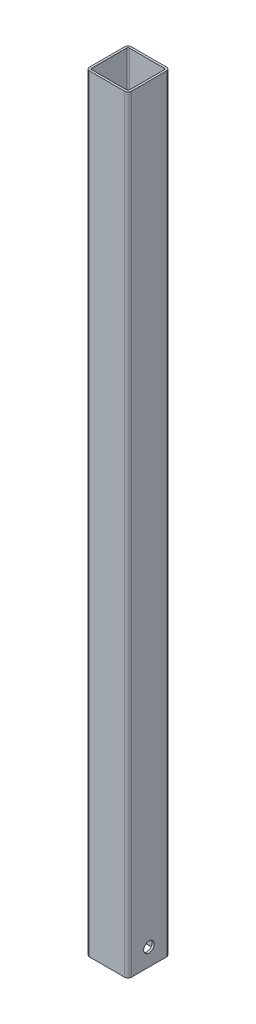
ISO-10303-21;
HEADER;
FILE_DESCRIPTION(('STEP AP214'),'2;1');
FILE_NAME('part.step','',(''),(''),'','','');
FILE_SCHEMA(('AUTOMOTIVE_DESIGN { 1 0 10303 214 1 1 1 1 }'));
ENDSEC;
DATA;
#1=APPLICATION_CONTEXT('core data for automotive mechanical design processes');
#2=APPLICATION_PROTOCOL_DEFINITION('international standard','automotive_design',2000,#1);
#3=PRODUCT_CONTEXT('',#1,'mechanical');
#4=PRODUCT('Part','Part','',(#3));
#5=PRODUCT_RELATED_PRODUCT_CATEGORY('part','',(#4));
#6=PRODUCT_DEFINITION_FORMATION('','',#4);
#7=PRODUCT_DEFINITION_CONTEXT('part definition',#1,'design');
#8=PRODUCT_DEFINITION('design','',#6,#7);
#9=PRODUCT_DEFINITION_SHAPE('','',#8);
#10=(LENGTH_UNIT() NAMED_UNIT(*) SI_UNIT(.MILLI.,.METRE.));
#11=(NAMED_UNIT(*) PLANE_ANGLE_UNIT() SI_UNIT($,.RADIAN.));
#12=(NAMED_UNIT(*) SI_UNIT($,.STERADIAN.) SOLID_ANGLE_UNIT());
#13=UNCERTAINTY_MEASURE_WITH_UNIT(LENGTH_MEASURE(1.E-05),#10,'distance_accuracy_value','');
#14=(GEOMETRIC_REPRESENTATION_CONTEXT(3) GLOBAL_UNCERTAINTY_ASSIGNED_CONTEXT((#13)) GLOBAL_UNIT_ASSIGNED_CONTEXT((#10,
#11,#12)) REPRESENTATION_CONTEXT('',''));
#15=CARTESIAN_POINT('',(0.,0.,0.));
#16=DIRECTION('',(0.,0.,1.));
#17=DIRECTION('',(1.,0.,0.));
#18=AXIS2_PLACEMENT_3D('',#15,#16,#17);
#19=CARTESIAN_POINT('',(-25.,1100.,25.));
#20=DIRECTION('',(0.,1.,0.));
#21=DIRECTION('',(0.,0.,1.));
#22=AXIS2_PLACEMENT_3D('',#19,#20,#21);
#23=PLANE('',#22);
#24=CARTESIAN_POINT('',(-25.,1100.,25.));
#25=DIRECTION('',(0.,1.,0.));
#26=DIRECTION('',(0.,0.,1.));
#27=AXIS2_PLACEMENT_3D('',#24,#25,#26);
#28=CIRCLE('',#27,5.);
#29=CARTESIAN_POINT('',(-30.,1100.,25.));
#30=VERTEX_POINT('',#29);
#31=CARTESIAN_POINT('',(-25.,1100.,30.));
#32=VERTEX_POINT('',#31);
#33=EDGE_CURVE('E264',#30,#32,#28,.T.);
#34=ORIENTED_EDGE('',*,*,#33,.T.);
#35=DIRECTION('',(1.,0.,0.));
#36=VECTOR('',#35,1.);
#37=CARTESIAN_POINT('',(-25.,1100.,30.));
#38=LINE('',#37,#36);
#39=CARTESIAN_POINT('',(25.,1100.,30.));
#40=VERTEX_POINT('',#39);
#41=EDGE_CURVE('E267',#32,#40,#38,.T.);
#42=ORIENTED_EDGE('',*,*,#41,.T.);
#43=CARTESIAN_POINT('',(25.,1100.,25.));
#44=DIRECTION('',(0.,1.,0.));
#45=DIRECTION('',(0.,0.,1.));
#46=AXIS2_PLACEMENT_3D('',#43,#44,#45);
#47=CIRCLE('',#46,5.);
#48=CARTESIAN_POINT('',(30.,1100.,25.));
#49=VERTEX_POINT('',#48);
#50=EDGE_CURVE('E270',#40,#49,#47,.T.);
#51=ORIENTED_EDGE('',*,*,#50,.T.);
#52=DIRECTION('',(0.,0.,-1.));
#53=VECTOR('',#52,1.);
#54=CARTESIAN_POINT('',(30.,1100.,-25.));
#55=LINE('',#54,#53);
#56=CARTESIAN_POINT('',(30.,1100.,-25.));
#57=VERTEX_POINT('',#56);
#58=EDGE_CURVE('E272',#49,#57,#55,.T.);
#59=ORIENTED_EDGE('',*,*,#58,.T.);
#60=CARTESIAN_POINT('',(25.,1100.,-25.));
#61=DIRECTION('',(0.,1.,0.));
#62=DIRECTION('',(0.,0.,-1.));
#63=AXIS2_PLACEMENT_3D('',#60,#61,#62);
#64=CIRCLE('',#63,5.);
#65=CARTESIAN_POINT('',(25.,1100.,-30.));
#66=VERTEX_POINT('',#65);
#67=EDGE_CURVE('E274',#57,#66,#64,.T.);
#68=ORIENTED_EDGE('',*,*,#67,.T.);
#69=DIRECTION('',(-1.,0.,0.));
#70=VECTOR('',#69,1.);
#71=CARTESIAN_POINT('',(-25.,1100.,-30.));
#72=LINE('',#71,#70);
#73=CARTESIAN_POINT('',(-25.,1100.,-30.));
#74=VERTEX_POINT('',#73);
#75=EDGE_CURVE('E276',#66,#74,#72,.T.);
#76=ORIENTED_EDGE('',*,*,#75,.T.);
#77=CARTESIAN_POINT('',(-25.,1100.,-25.));
#78=DIRECTION('',(0.,1.,0.));
#79=DIRECTION('',(0.,0.,1.));
#80=AXIS2_PLACEMENT_3D('',#77,#78,#79);
#81=CIRCLE('',#80,5.);
#82=CARTESIAN_POINT('',(-30.,1100.,-25.));
#83=VERTEX_POINT('',#82);
#84=EDGE_CURVE('E278',#74,#83,#81,.T.);
#85=ORIENTED_EDGE('',*,*,#84,.T.);
#86=DIRECTION('',(0.,0.,1.));
#87=VECTOR('',#86,1.);
#88=CARTESIAN_POINT('',(-30.,1100.,-25.));
#89=LINE('',#88,#87);
#90=EDGE_CURVE('E280',#83,#30,#89,.T.);
#91=ORIENTED_EDGE('',*,*,#90,.T.);
#92=EDGE_LOOP('',(#34,#42,#51,#59,#68,#76,#85,#91));
#93=FACE_BOUND('',#92,.T.);
#94=DIRECTION('',(1.,0.,0.));
#95=VECTOR('',#94,1.);
#96=CARTESIAN_POINT('',(-25.,1100.,27.));
#97=LINE('',#96,#95);
#98=CARTESIAN_POINT('',(-25.,1100.,27.));
#99=VERTEX_POINT('',#98);
#100=CARTESIAN_POINT('',(25.,1100.,27.));
#101=VERTEX_POINT('',#100);
#102=EDGE_CURVE('E205',#99,#101,#97,.T.);
#103=ORIENTED_EDGE('',*,*,#102,.F.);
#104=CARTESIAN_POINT('',(-25.,1100.,25.));
#105=DIRECTION('',(0.,1.,0.));
#106=DIRECTION('',(1.,0.,0.));
#107=AXIS2_PLACEMENT_3D('',#104,#105,#106);
#108=CIRCLE('',#107,2.);
#109=CARTESIAN_POINT('',(-27.,1100.,25.));
#110=VERTEX_POINT('',#109);
#111=EDGE_CURVE('E197',#110,#99,#108,.T.);
#112=ORIENTED_EDGE('',*,*,#111,.F.);
#113=DIRECTION('',(0.,0.,1.));
#114=VECTOR('',#113,1.);
#115=CARTESIAN_POINT('',(-27.,1100.,-25.));
#116=LINE('',#115,#114);
#117=CARTESIAN_POINT('',(-27.,1100.,-25.));
#118=VERTEX_POINT('',#117);
#119=EDGE_CURVE('E231',#118,#110,#116,.T.);
#120=ORIENTED_EDGE('',*,*,#119,.F.);
#121=CARTESIAN_POINT('',(-25.,1100.,-25.));
#122=DIRECTION('',(0.,1.,0.));
#123=DIRECTION('',(1.,0.,0.));
#124=AXIS2_PLACEMENT_3D('',#121,#122,#123);
#125=CIRCLE('',#124,2.);
#126=CARTESIAN_POINT('',(-25.,1100.,-27.));
#127=VERTEX_POINT('',#126);
#128=EDGE_CURVE('E229',#127,#118,#125,.T.);
#129=ORIENTED_EDGE('',*,*,#128,.F.);
#130=DIRECTION('',(-1.,0.,0.));
#131=VECTOR('',#130,1.);
#132=CARTESIAN_POINT('',(-25.,1100.,-27.));
#133=LINE('',#132,#131);
#134=CARTESIAN_POINT('',(25.,1100.,-27.));
#135=VERTEX_POINT('',#134);
#136=EDGE_CURVE('E227',#135,#127,#133,.T.);
#137=ORIENTED_EDGE('',*,*,#136,.F.);
#138=CARTESIAN_POINT('',(25.,1100.,-25.));
#139=DIRECTION('',(0.,1.,0.));
#140=DIRECTION('',(1.,0.,0.));
#141=AXIS2_PLACEMENT_3D('',#138,#139,#140);
#142=CIRCLE('',#141,2.);
#143=CARTESIAN_POINT('',(27.,1100.,-25.));
#144=VERTEX_POINT('',#143);
#145=EDGE_CURVE('E225',#144,#135,#142,.T.);
#146=ORIENTED_EDGE('',*,*,#145,.F.);
#147=DIRECTION('',(0.,0.,-1.));
#148=VECTOR('',#147,1.);
#149=CARTESIAN_POINT('',(27.,1100.,-25.));
#150=LINE('',#149,#148);
#151=CARTESIAN_POINT('',(27.,1100.,25.));
#152=VERTEX_POINT('',#151);
#153=EDGE_CURVE('E220',#152,#144,#150,.T.);
#154=ORIENTED_EDGE('',*,*,#153,.F.);
#155=CARTESIAN_POINT('',(25.,1100.,25.));
#156=DIRECTION('',(0.,1.,0.));
#157=DIRECTION('',(1.,0.,0.));
#158=AXIS2_PLACEMENT_3D('',#155,#156,#157);
#159=CIRCLE('',#158,2.);
#160=EDGE_CURVE('E218',#101,#152,#159,.T.);
#161=ORIENTED_EDGE('',*,*,#160,.F.);
#162=EDGE_LOOP('',(#103,#112,#120,#129,#137,#146,#154,#161));
#163=FACE_BOUND('',#162,.T.);
#164=ADVANCED_FACE('F83',(#93,#163),#23,.T.);
#165=CARTESIAN_POINT('',(-25.,0.,25.));
#166=DIRECTION('',(0.,1.,0.));
#167=DIRECTION('',(0.,0.,1.));
#168=AXIS2_PLACEMENT_3D('',#165,#166,#167);
#169=PLANE('',#168);
#170=CARTESIAN_POINT('',(-25.,0.,25.));
#171=DIRECTION('',(0.,1.,0.));
#172=DIRECTION('',(0.,0.,1.));
#173=AXIS2_PLACEMENT_3D('',#170,#171,#172);
#174=CIRCLE('',#173,5.);
#175=CARTESIAN_POINT('',(-30.,0.,25.));
#176=VERTEX_POINT('',#175);
#177=CARTESIAN_POINT('',(-25.,0.,30.));
#178=VERTEX_POINT('',#177);
#179=EDGE_CURVE('E213',#176,#178,#174,.T.);
#180=ORIENTED_EDGE('',*,*,#179,.F.);
#181=DIRECTION('',(0.,0.,1.));
#182=VECTOR('',#181,1.);
#183=CARTESIAN_POINT('',(-30.,0.,-25.));
#184=LINE('',#183,#182);
#185=CARTESIAN_POINT('',(-30.,0.,-25.));
#186=VERTEX_POINT('',#185);
#187=EDGE_CURVE('E268',#186,#176,#184,.T.);
#188=ORIENTED_EDGE('',*,*,#187,.F.);
#189=CARTESIAN_POINT('',(-25.,0.,-25.));
#190=DIRECTION('',(0.,1.,0.));
#191=DIRECTION('',(0.,0.,1.));
#192=AXIS2_PLACEMENT_3D('',#189,#190,#191);
#193=CIRCLE('',#192,5.);
#194=CARTESIAN_POINT('',(-25.,0.,-30.));
#195=VERTEX_POINT('',#194);
#196=EDGE_CURVE('E295',#195,#186,#193,.T.);
#197=ORIENTED_EDGE('',*,*,#196,.F.);
#198=DIRECTION('',(-1.,0.,0.));
#199=VECTOR('',#198,1.);
#200=CARTESIAN_POINT('',(-25.,0.,-30.));
#201=LINE('',#200,#199);
#202=CARTESIAN_POINT('',(25.,0.,-30.));
#203=VERTEX_POINT('',#202);
#204=EDGE_CURVE('E293',#203,#195,#201,.T.);
#205=ORIENTED_EDGE('',*,*,#204,.F.);
#206=CARTESIAN_POINT('',(25.,0.,-25.));
#207=DIRECTION('',(0.,1.,0.));
#208=DIRECTION('',(0.,0.,-1.));
#209=AXIS2_PLACEMENT_3D('',#206,#207,#208);
#210=CIRCLE('',#209,5.);
#211=CARTESIAN_POINT('',(30.,0.,-25.));
#212=VERTEX_POINT('',#211);
#213=EDGE_CURVE('E291',#212,#203,#210,.T.);
#214=ORIENTED_EDGE('',*,*,#213,.F.);
#215=DIRECTION('',(0.,0.,-1.));
#216=VECTOR('',#215,1.);
#217=CARTESIAN_POINT('',(30.,0.,-25.));
#218=LINE('',#217,#216);
#219=CARTESIAN_POINT('',(30.,0.,25.));
#220=VERTEX_POINT('',#219);
#221=EDGE_CURVE('E289',#220,#212,#218,.T.);
#222=ORIENTED_EDGE('',*,*,#221,.F.);
#223=CARTESIAN_POINT('',(25.,0.,25.));
#224=DIRECTION('',(0.,1.,0.));
#225=DIRECTION('',(0.,0.,1.));
#226=AXIS2_PLACEMENT_3D('',#223,#224,#225);
#227=CIRCLE('',#226,5.);
#228=CARTESIAN_POINT('',(25.,0.,30.));
#229=VERTEX_POINT('',#228);
#230=EDGE_CURVE('E287',#229,#220,#227,.T.);
#231=ORIENTED_EDGE('',*,*,#230,.F.);
#232=DIRECTION('',(1.,0.,0.));
#233=VECTOR('',#232,1.);
#234=CARTESIAN_POINT('',(-25.,0.,30.));
#235=LINE('',#234,#233);
#236=EDGE_CURVE('E285',#178,#229,#235,.T.);
#237=ORIENTED_EDGE('',*,*,#236,.F.);
#238=EDGE_LOOP('',(#180,#188,#197,#205,#214,#222,#231,#237));
#239=FACE_BOUND('',#238,.T.);
#240=CARTESIAN_POINT('',(-25.,0.,25.));
#241=DIRECTION('',(0.,1.,0.));
#242=DIRECTION('',(1.,0.,0.));
#243=AXIS2_PLACEMENT_3D('',#240,#241,#242);
#244=CIRCLE('',#243,2.);
#245=CARTESIAN_POINT('',(-27.,0.,25.));
#246=VERTEX_POINT('',#245);
#247=CARTESIAN_POINT('',(-25.,0.,27.));
#248=VERTEX_POINT('',#247);
#249=EDGE_CURVE('E107',#246,#248,#244,.T.);
#250=ORIENTED_EDGE('',*,*,#249,.T.);
#251=DIRECTION('',(1.,0.,0.));
#252=VECTOR('',#251,1.);
#253=CARTESIAN_POINT('',(-25.,0.,27.));
#254=LINE('',#253,#252);
#255=CARTESIAN_POINT('',(25.,0.,27.));
#256=VERTEX_POINT('',#255);
#257=EDGE_CURVE('E212',#248,#256,#254,.T.);
#258=ORIENTED_EDGE('',*,*,#257,.T.);
#259=CARTESIAN_POINT('',(25.,0.,25.));
#260=DIRECTION('',(0.,1.,0.));
#261=DIRECTION('',(1.,0.,0.));
#262=AXIS2_PLACEMENT_3D('',#259,#260,#261);
#263=CIRCLE('',#262,2.);
#264=CARTESIAN_POINT('',(27.,0.,25.));
#265=VERTEX_POINT('',#264);
#266=EDGE_CURVE('E236',#256,#265,#263,.T.);
#267=ORIENTED_EDGE('',*,*,#266,.T.);
#268=DIRECTION('',(0.,0.,-1.));
#269=VECTOR('',#268,1.);
#270=CARTESIAN_POINT('',(27.,0.,-25.));
#271=LINE('',#270,#269);
#272=CARTESIAN_POINT('',(27.,0.,-25.));
#273=VERTEX_POINT('',#272);
#274=EDGE_CURVE('E239',#265,#273,#271,.T.);
#275=ORIENTED_EDGE('',*,*,#274,.T.);
#276=CARTESIAN_POINT('',(25.,0.,-25.));
#277=DIRECTION('',(0.,1.,0.));
#278=DIRECTION('',(1.,0.,0.));
#279=AXIS2_PLACEMENT_3D('',#276,#277,#278);
#280=CIRCLE('',#279,2.);
#281=CARTESIAN_POINT('',(25.,0.,-27.));
#282=VERTEX_POINT('',#281);
#283=EDGE_CURVE('E242',#273,#282,#280,.T.);
#284=ORIENTED_EDGE('',*,*,#283,.T.);
#285=DIRECTION('',(-1.,0.,0.));
#286=VECTOR('',#285,1.);
#287=CARTESIAN_POINT('',(-25.,0.,-27.));
#288=LINE('',#287,#286);
#289=CARTESIAN_POINT('',(-25.,0.,-27.));
#290=VERTEX_POINT('',#289);
#291=EDGE_CURVE('E245',#282,#290,#288,.T.);
#292=ORIENTED_EDGE('',*,*,#291,.T.);
#293=CARTESIAN_POINT('',(-25.,0.,-25.));
#294=DIRECTION('',(0.,1.,0.));
#295=DIRECTION('',(1.,0.,0.));
#296=AXIS2_PLACEMENT_3D('',#293,#294,#295);
#297=CIRCLE('',#296,2.);
#298=CARTESIAN_POINT('',(-27.,0.,-25.));
#299=VERTEX_POINT('',#298);
#300=EDGE_CURVE('E248',#290,#299,#297,.T.);
#301=ORIENTED_EDGE('',*,*,#300,.T.);
#302=DIRECTION('',(0.,0.,1.));
#303=VECTOR('',#302,1.);
#304=CARTESIAN_POINT('',(-27.,0.,-25.));
#305=LINE('',#304,#303);
#306=EDGE_CURVE('E206',#299,#246,#305,.T.);
#307=ORIENTED_EDGE('',*,*,#306,.T.);
#308=EDGE_LOOP('',(#250,#258,#267,#275,#284,#292,#301,#307));
#309=FACE_BOUND('',#308,.T.);
#310=ADVANCED_FACE('F326',(#239,#309),#169,.F.);
#311=CARTESIAN_POINT('',(-25.,1100.,25.));
#312=DIRECTION('',(0.,-1.,0.));
#313=DIRECTION('',(0.,0.,-1.));
#314=AXIS2_PLACEMENT_3D('',#311,#312,#313);
#315=CYLINDRICAL_SURFACE('',#314,5.);
#316=ORIENTED_EDGE('',*,*,#179,.T.);
#317=DIRECTION('',(0.,-1.,0.));
#318=VECTOR('',#317,1.);
#319=CARTESIAN_POINT('',(-25.,1100.,30.));
#320=LINE('',#319,#318);
#321=EDGE_CURVE('E12',#32,#178,#320,.T.);
#322=ORIENTED_EDGE('',*,*,#321,.F.);
#323=ORIENTED_EDGE('',*,*,#33,.F.);
#324=DIRECTION('',(0.,-1.,0.));
#325=VECTOR('',#324,1.);
#326=CARTESIAN_POINT('',(-30.,1100.,25.));
#327=LINE('',#326,#325);
#328=EDGE_CURVE('E282',#30,#176,#327,.T.);
#329=ORIENTED_EDGE('',*,*,#328,.T.);
#330=EDGE_LOOP('',(#316,#322,#323,#329));
#331=FACE_BOUND('',#330,.T.);
#332=ADVANCED_FACE('F85',(#331),#315,.T.);
#333=CARTESIAN_POINT('',(-25.,1100.,30.));
#334=DIRECTION('',(0.,0.,-1.));
#335=DIRECTION('',(-1.,0.,0.));
#336=AXIS2_PLACEMENT_3D('',#333,#334,#335);
#337=PLANE('',#336);
#338=ORIENTED_EDGE('',*,*,#236,.T.);
#339=DIRECTION('',(0.,-1.,0.));
#340=VECTOR('',#339,1.);
#341=CARTESIAN_POINT('',(25.,1100.,30.));
#342=LINE('',#341,#340);
#343=EDGE_CURVE('E92',#40,#229,#342,.T.);
#344=ORIENTED_EDGE('',*,*,#343,.F.);
#345=ORIENTED_EDGE('',*,*,#41,.F.);
#346=ORIENTED_EDGE('',*,*,#321,.T.);
#347=EDGE_LOOP('',(#338,#344,#345,#346));
#348=FACE_BOUND('',#347,.T.);
#349=ADVANCED_FACE('F343',(#348),#337,.F.);
#350=CARTESIAN_POINT('',(25.,1100.,25.));
#351=DIRECTION('',(0.,-1.,0.));
#352=DIRECTION('',(0.,0.,-1.));
#353=AXIS2_PLACEMENT_3D('',#350,#351,#352);
#354=CYLINDRICAL_SURFACE('',#353,5.);
#355=ORIENTED_EDGE('',*,*,#230,.T.);
#356=DIRECTION('',(0.,-1.,0.));
#357=VECTOR('',#356,1.);
#358=CARTESIAN_POINT('',(30.,1100.,25.));
#359=LINE('',#358,#357);
#360=EDGE_CURVE('E312',#49,#220,#359,.T.);
#361=ORIENTED_EDGE('',*,*,#360,.F.);
#362=ORIENTED_EDGE('',*,*,#50,.F.);
#363=ORIENTED_EDGE('',*,*,#343,.T.);
#364=EDGE_LOOP('',(#355,#361,#362,#363));
#365=FACE_BOUND('',#364,.T.);
#366=ADVANCED_FACE('F320',(#365),#354,.T.);
#367=CARTESIAN_POINT('',(30.,1100.,-25.));
#368=DIRECTION('',(-1.,0.,0.));
#369=DIRECTION('',(0.,0.,1.));
#370=AXIS2_PLACEMENT_3D('',#367,#368,#369);
#371=PLANE('',#370);
#372=CARTESIAN_POINT('',(30.,25.,0.));
#373=DIRECTION('',(1.,0.,0.));
#374=DIRECTION('',(0.,0.,-1.));
#375=AXIS2_PLACEMENT_3D('',#372,#373,#374);
#376=CIRCLE('',#375,7.5);
#377=CARTESIAN_POINT('',(30.,25.,-7.5));
#378=VERTEX_POINT('',#377);
#379=EDGE_CURVE('E385',#378,#378,#376,.T.);
#380=ORIENTED_EDGE('',*,*,#379,.F.);
#381=EDGE_LOOP('',(#380));
#382=FACE_BOUND('',#381,.T.);
#383=ORIENTED_EDGE('',*,*,#221,.T.);
#384=DIRECTION('',(0.,-1.,0.));
#385=VECTOR('',#384,1.);
#386=CARTESIAN_POINT('',(30.,1100.,-25.));
#387=LINE('',#386,#385);
#388=EDGE_CURVE('E309',#57,#212,#387,.T.);
#389=ORIENTED_EDGE('',*,*,#388,.F.);
#390=ORIENTED_EDGE('',*,*,#58,.F.);
#391=ORIENTED_EDGE('',*,*,#360,.T.);
#392=EDGE_LOOP('',(#383,#389,#390,#391));
#393=FACE_BOUND('',#392,.T.);
#394=ADVANCED_FACE('F332',(#382,#393),#371,.F.);
#395=CARTESIAN_POINT('',(25.,1100.,-25.));
#396=DIRECTION('',(0.,-1.,0.));
#397=DIRECTION('',(0.,0.,-1.));
#398=AXIS2_PLACEMENT_3D('',#395,#396,#397);
#399=CYLINDRICAL_SURFACE('',#398,5.);
#400=ORIENTED_EDGE('',*,*,#213,.T.);
#401=DIRECTION('',(0.,-1.,0.));
#402=VECTOR('',#401,1.);
#403=CARTESIAN_POINT('',(25.,1100.,-30.));
#404=LINE('',#403,#402);
#405=EDGE_CURVE('E306',#66,#203,#404,.T.);
#406=ORIENTED_EDGE('',*,*,#405,.F.);
#407=ORIENTED_EDGE('',*,*,#67,.F.);
#408=ORIENTED_EDGE('',*,*,#388,.T.);
#409=EDGE_LOOP('',(#400,#406,#407,#408));
#410=FACE_BOUND('',#409,.T.);
#411=ADVANCED_FACE('F336',(#410),#399,.T.);
#412=CARTESIAN_POINT('',(-25.,1100.,-30.));
#413=DIRECTION('',(0.,0.,1.));
#414=DIRECTION('',(1.,0.,0.));
#415=AXIS2_PLACEMENT_3D('',#412,#413,#414);
#416=PLANE('',#415);
#417=ORIENTED_EDGE('',*,*,#204,.T.);
#418=DIRECTION('',(0.,-1.,0.));
#419=VECTOR('',#418,1.);
#420=CARTESIAN_POINT('',(-25.,1100.,-30.));
#421=LINE('',#420,#419);
#422=EDGE_CURVE('E303',#74,#195,#421,.T.);
#423=ORIENTED_EDGE('',*,*,#422,.F.);
#424=ORIENTED_EDGE('',*,*,#75,.F.);
#425=ORIENTED_EDGE('',*,*,#405,.T.);
#426=EDGE_LOOP('',(#417,#423,#424,#425));
#427=FACE_BOUND('',#426,.T.);
#428=ADVANCED_FACE('F356',(#427),#416,.F.);
#429=CARTESIAN_POINT('',(-25.,1100.,-25.));
#430=DIRECTION('',(0.,-1.,0.));
#431=DIRECTION('',(0.,0.,-1.));
#432=AXIS2_PLACEMENT_3D('',#429,#430,#431);
#433=CYLINDRICAL_SURFACE('',#432,5.);
#434=ORIENTED_EDGE('',*,*,#196,.T.);
#435=DIRECTION('',(0.,-1.,0.));
#436=VECTOR('',#435,1.);
#437=CARTESIAN_POINT('',(-30.,1100.,-25.));
#438=LINE('',#437,#436);
#439=EDGE_CURVE('E300',#83,#186,#438,.T.);
#440=ORIENTED_EDGE('',*,*,#439,.F.);
#441=ORIENTED_EDGE('',*,*,#84,.F.);
#442=ORIENTED_EDGE('',*,*,#422,.T.);
#443=EDGE_LOOP('',(#434,#440,#441,#442));
#444=FACE_BOUND('',#443,.T.);
#445=ADVANCED_FACE('F354',(#444),#433,.T.);
#446=CARTESIAN_POINT('',(-30.,1100.,-25.));
#447=DIRECTION('',(1.,0.,0.));
#448=DIRECTION('',(0.,0.,-1.));
#449=AXIS2_PLACEMENT_3D('',#446,#447,#448);
#450=PLANE('',#449);
#451=CARTESIAN_POINT('',(-30.,25.,0.));
#452=DIRECTION('',(1.,0.,0.));
#453=DIRECTION('',(0.,0.,-1.));
#454=AXIS2_PLACEMENT_3D('',#451,#452,#453);
#455=CIRCLE('',#454,7.5);
#456=CARTESIAN_POINT('',(-30.,25.,-7.5));
#457=VERTEX_POINT('',#456);
#458=EDGE_CURVE('E383',#457,#457,#455,.T.);
#459=ORIENTED_EDGE('',*,*,#458,.T.);
#460=EDGE_LOOP('',(#459));
#461=FACE_BOUND('',#460,.T.);
#462=ORIENTED_EDGE('',*,*,#187,.T.);
#463=ORIENTED_EDGE('',*,*,#328,.F.);
#464=ORIENTED_EDGE('',*,*,#90,.F.);
#465=ORIENTED_EDGE('',*,*,#439,.T.);
#466=EDGE_LOOP('',(#462,#463,#464,#465));
#467=FACE_BOUND('',#466,.T.);
#468=ADVANCED_FACE('F349',(#461,#467),#450,.F.);
#469=CARTESIAN_POINT('',(-25.,1100.,25.));
#470=DIRECTION('',(0.,-1.,0.));
#471=DIRECTION('',(0.,0.,-1.));
#472=AXIS2_PLACEMENT_3D('',#469,#470,#471);
#473=CYLINDRICAL_SURFACE('',#472,2.);
#474=ORIENTED_EDGE('',*,*,#249,.F.);
#475=DIRECTION('',(0.,-1.,0.));
#476=VECTOR('',#475,1.);
#477=CARTESIAN_POINT('',(-27.,1100.,25.));
#478=LINE('',#477,#476);
#479=EDGE_CURVE('E201',#110,#246,#478,.T.);
#480=ORIENTED_EDGE('',*,*,#479,.F.);
#481=ORIENTED_EDGE('',*,*,#111,.T.);
#482=DIRECTION('',(0.,-1.,0.));
#483=VECTOR('',#482,1.);
#484=CARTESIAN_POINT('',(-25.,1100.,27.));
#485=LINE('',#484,#483);
#486=EDGE_CURVE('E200',#99,#248,#485,.T.);
#487=ORIENTED_EDGE('',*,*,#486,.T.);
#488=EDGE_LOOP('',(#474,#480,#481,#487));
#489=FACE_BOUND('',#488,.T.);
#490=ADVANCED_FACE('F199',(#489),#473,.F.);
#491=CARTESIAN_POINT('',(-25.,1100.,27.));
#492=DIRECTION('',(0.,0.,-1.));
#493=DIRECTION('',(-1.,0.,0.));
#494=AXIS2_PLACEMENT_3D('',#491,#492,#493);
#495=PLANE('',#494);
#496=ORIENTED_EDGE('',*,*,#257,.F.);
#497=ORIENTED_EDGE('',*,*,#486,.F.);
#498=ORIENTED_EDGE('',*,*,#102,.T.);
#499=DIRECTION('',(0.,-1.,0.));
#500=VECTOR('',#499,1.);
#501=CARTESIAN_POINT('',(25.,1100.,27.));
#502=LINE('',#501,#500);
#503=EDGE_CURVE('E214',#101,#256,#502,.T.);
#504=ORIENTED_EDGE('',*,*,#503,.T.);
#505=EDGE_LOOP('',(#496,#497,#498,#504));
#506=FACE_BOUND('',#505,.T.);
#507=ADVANCED_FACE('F209',(#506),#495,.T.);
#508=CARTESIAN_POINT('',(25.,1100.,25.));
#509=DIRECTION('',(0.,-1.,0.));
#510=DIRECTION('',(0.,0.,-1.));
#511=AXIS2_PLACEMENT_3D('',#508,#509,#510);
#512=CYLINDRICAL_SURFACE('',#511,2.);
#513=ORIENTED_EDGE('',*,*,#266,.F.);
#514=ORIENTED_EDGE('',*,*,#503,.F.);
#515=ORIENTED_EDGE('',*,*,#160,.T.);
#516=DIRECTION('',(0.,-1.,0.));
#517=VECTOR('',#516,1.);
#518=CARTESIAN_POINT('',(27.,1100.,25.));
#519=LINE('',#518,#517);
#520=EDGE_CURVE('E261',#152,#265,#519,.T.);
#521=ORIENTED_EDGE('',*,*,#520,.T.);
#522=EDGE_LOOP('',(#513,#514,#515,#521));
#523=FACE_BOUND('',#522,.T.);
#524=ADVANCED_FACE('F399',(#523),#512,.F.);
#525=CARTESIAN_POINT('',(27.,1100.,-25.));
#526=DIRECTION('',(-1.,0.,0.));
#527=DIRECTION('',(0.,0.,1.));
#528=AXIS2_PLACEMENT_3D('',#525,#526,#527);
#529=PLANE('',#528);
#530=CARTESIAN_POINT('',(27.,25.,0.));
#531=DIRECTION('',(-1.,0.,0.));
#532=DIRECTION('',(0.,0.,1.));
#533=AXIS2_PLACEMENT_3D('',#530,#531,#532);
#534=CIRCLE('',#533,7.5);
#535=CARTESIAN_POINT('',(27.,25.,7.5));
#536=VERTEX_POINT('',#535);
#537=EDGE_CURVE('E234',#536,#536,#534,.T.);
#538=ORIENTED_EDGE('',*,*,#537,.F.);
#539=EDGE_LOOP('',(#538));
#540=FACE_BOUND('',#539,.T.);
#541=ORIENTED_EDGE('',*,*,#274,.F.);
#542=ORIENTED_EDGE('',*,*,#520,.F.);
#543=ORIENTED_EDGE('',*,*,#153,.T.);
#544=DIRECTION('',(0.,-1.,0.));
#545=VECTOR('',#544,1.);
#546=CARTESIAN_POINT('',(27.,1100.,-25.));
#547=LINE('',#546,#545);
#548=EDGE_CURVE('E259',#144,#273,#547,.T.);
#549=ORIENTED_EDGE('',*,*,#548,.T.);
#550=EDGE_LOOP('',(#541,#542,#543,#549));
#551=FACE_BOUND('',#550,.T.);
#552=ADVANCED_FACE('F396',(#540,#551),#529,.T.);
#553=CARTESIAN_POINT('',(25.,1100.,-25.));
#554=DIRECTION('',(0.,-1.,0.));
#555=DIRECTION('',(0.,0.,-1.));
#556=AXIS2_PLACEMENT_3D('',#553,#554,#555);
#557=CYLINDRICAL_SURFACE('',#556,2.);
#558=ORIENTED_EDGE('',*,*,#283,.F.);
#559=ORIENTED_EDGE('',*,*,#548,.F.);
#560=ORIENTED_EDGE('',*,*,#145,.T.);
#561=DIRECTION('',(0.,-1.,0.));
#562=VECTOR('',#561,1.);
#563=CARTESIAN_POINT('',(25.,1100.,-27.));
#564=LINE('',#563,#562);
#565=EDGE_CURVE('E257',#135,#282,#564,.T.);
#566=ORIENTED_EDGE('',*,*,#565,.T.);
#567=EDGE_LOOP('',(#558,#559,#560,#566));
#568=FACE_BOUND('',#567,.T.);
#569=ADVANCED_FACE('F398',(#568),#557,.F.);
#570=CARTESIAN_POINT('',(-25.,1100.,-27.));
#571=DIRECTION('',(0.,0.,1.));
#572=DIRECTION('',(1.,0.,0.));
#573=AXIS2_PLACEMENT_3D('',#570,#571,#572);
#574=PLANE('',#573);
#575=ORIENTED_EDGE('',*,*,#291,.F.);
#576=ORIENTED_EDGE('',*,*,#565,.F.);
#577=ORIENTED_EDGE('',*,*,#136,.T.);
#578=DIRECTION('',(0.,-1.,0.));
#579=VECTOR('',#578,1.);
#580=CARTESIAN_POINT('',(-25.,1100.,-27.));
#581=LINE('',#580,#579);
#582=EDGE_CURVE('E255',#127,#290,#581,.T.);
#583=ORIENTED_EDGE('',*,*,#582,.T.);
#584=EDGE_LOOP('',(#575,#576,#577,#583));
#585=FACE_BOUND('',#584,.T.);
#586=ADVANCED_FACE('F416',(#585),#574,.T.);
#587=CARTESIAN_POINT('',(-25.,1100.,-25.));
#588=DIRECTION('',(0.,-1.,0.));
#589=DIRECTION('',(0.,0.,-1.));
#590=AXIS2_PLACEMENT_3D('',#587,#588,#589);
#591=CYLINDRICAL_SURFACE('',#590,2.);
#592=ORIENTED_EDGE('',*,*,#300,.F.);
#593=ORIENTED_EDGE('',*,*,#582,.F.);
#594=ORIENTED_EDGE('',*,*,#128,.T.);
#595=DIRECTION('',(0.,-1.,0.));
#596=VECTOR('',#595,1.);
#597=CARTESIAN_POINT('',(-27.,1100.,-25.));
#598=LINE('',#597,#596);
#599=EDGE_CURVE('E99',#118,#299,#598,.T.);
#600=ORIENTED_EDGE('',*,*,#599,.T.);
#601=EDGE_LOOP('',(#592,#593,#594,#600));
#602=FACE_BOUND('',#601,.T.);
#603=ADVANCED_FACE('F420',(#602),#591,.F.);
#604=CARTESIAN_POINT('',(-27.,1100.,-25.));
#605=DIRECTION('',(1.,0.,0.));
#606=DIRECTION('',(0.,0.,-1.));
#607=AXIS2_PLACEMENT_3D('',#604,#605,#606);
#608=PLANE('',#607);
#609=CARTESIAN_POINT('',(-27.,25.,0.));
#610=DIRECTION('',(1.,0.,0.));
#611=DIRECTION('',(0.,0.,-1.));
#612=AXIS2_PLACEMENT_3D('',#609,#610,#611);
#613=CIRCLE('',#612,7.5);
#614=CARTESIAN_POINT('',(-27.,25.,-7.5));
#615=VERTEX_POINT('',#614);
#616=EDGE_CURVE('E87',#615,#615,#613,.T.);
#617=ORIENTED_EDGE('',*,*,#616,.F.);
#618=EDGE_LOOP('',(#617));
#619=FACE_BOUND('',#618,.T.);
#620=ORIENTED_EDGE('',*,*,#306,.F.);
#621=ORIENTED_EDGE('',*,*,#599,.F.);
#622=ORIENTED_EDGE('',*,*,#119,.T.);
#623=ORIENTED_EDGE('',*,*,#479,.T.);
#624=EDGE_LOOP('',(#620,#621,#622,#623));
#625=FACE_BOUND('',#624,.T.);
#626=ADVANCED_FACE('F424',(#619,#625),#608,.T.);
#627=CARTESIAN_POINT('',(-30.,25.,0.));
#628=DIRECTION('',(1.,0.,0.));
#629=DIRECTION('',(0.,0.,-1.));
#630=AXIS2_PLACEMENT_3D('',#627,#628,#629);
#631=CYLINDRICAL_SURFACE('',#630,7.5);
#632=ORIENTED_EDGE('',*,*,#616,.T.);
#633=EDGE_LOOP('',(#632));
#634=FACE_BOUND('',#633,.T.);
#635=ORIENTED_EDGE('',*,*,#458,.F.);
#636=EDGE_LOOP('',(#635));
#637=FACE_BOUND('',#636,.T.);
#638=ADVANCED_FACE('F428',(#634,#637),#631,.F.);
#639=ORIENTED_EDGE('',*,*,#537,.T.);
#640=EDGE_LOOP('',(#639));
#641=FACE_BOUND('',#640,.T.);
#642=ORIENTED_EDGE('',*,*,#379,.T.);
#643=EDGE_LOOP('',(#642));
#644=FACE_BOUND('',#643,.T.);
#645=ADVANCED_FACE('F393',(#641,#644),#631,.F.);
#646=CLOSED_SHELL('',(#164,#310,#332,#349,#366,#394,#411,#428,#445,#468,#490,#507,#524,#552,
#569,#586,#603,#626,#638,#645));
#647=MANIFOLD_SOLID_BREP('B2',#646);
#648=ADVANCED_BREP_SHAPE_REPRESENTATION('',(#18,#647),#14);
#649=SHAPE_DEFINITION_REPRESENTATION(#9,#648);
ENDSEC;
END-ISO-10303-21;
